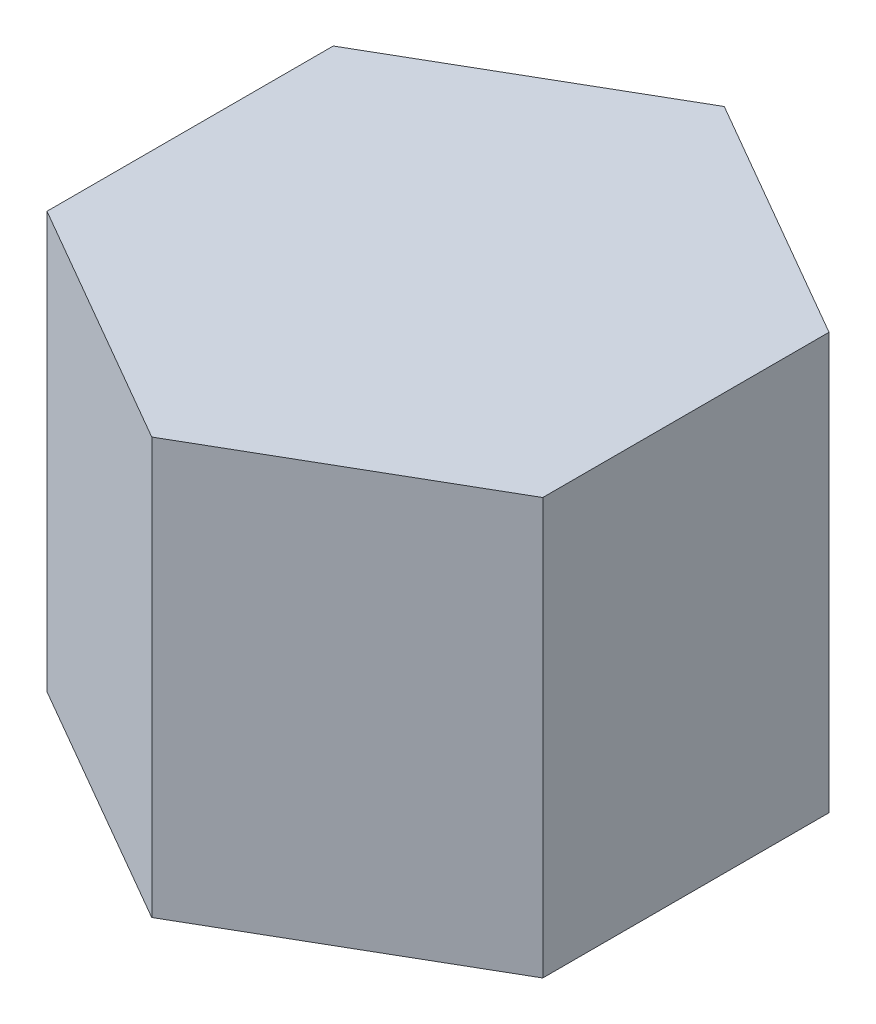
ISO-10303-21;
HEADER;
FILE_DESCRIPTION(('STEP AP214'),'2;1');
FILE_NAME('part.step','',(''),(''),'','','');
FILE_SCHEMA(('AUTOMOTIVE_DESIGN { 1 0 10303 214 1 1 1 1 }'));
ENDSEC;
DATA;
#1=APPLICATION_CONTEXT('core data for automotive mechanical design processes');
#2=APPLICATION_PROTOCOL_DEFINITION('international standard','automotive_design',2000,#1);
#3=PRODUCT_CONTEXT('',#1,'mechanical');
#4=PRODUCT('Part','Part','',(#3));
#5=PRODUCT_RELATED_PRODUCT_CATEGORY('part','',(#4));
#6=PRODUCT_DEFINITION_FORMATION('','',#4);
#7=PRODUCT_DEFINITION_CONTEXT('part definition',#1,'design');
#8=PRODUCT_DEFINITION('design','',#6,#7);
#9=PRODUCT_DEFINITION_SHAPE('','',#8);
#10=(LENGTH_UNIT() NAMED_UNIT(*) SI_UNIT(.MILLI.,.METRE.));
#11=(NAMED_UNIT(*) PLANE_ANGLE_UNIT() SI_UNIT($,.RADIAN.));
#12=(NAMED_UNIT(*) SI_UNIT($,.STERADIAN.) SOLID_ANGLE_UNIT());
#13=UNCERTAINTY_MEASURE_WITH_UNIT(LENGTH_MEASURE(1.E-05),#10,'distance_accuracy_value','');
#14=(GEOMETRIC_REPRESENTATION_CONTEXT(3) GLOBAL_UNCERTAINTY_ASSIGNED_CONTEXT((#13)) GLOBAL_UNIT_ASSIGNED_CONTEXT((#10,
#11,#12)) REPRESENTATION_CONTEXT('',''));
#15=CARTESIAN_POINT('',(0.,0.,0.));
#16=DIRECTION('',(0.,0.,1.));
#17=DIRECTION('',(1.,0.,0.));
#18=AXIS2_PLACEMENT_3D('',#15,#16,#17);
#19=CARTESIAN_POINT('',(205.839551417382,-147.556598747966,289.083895009141));
#20=DIRECTION('',(-0.499999999999943,0.,-0.866025403784471));
#21=DIRECTION('',(-0.866025403784471,0.,0.499999999999943));
#22=AXIS2_PLACEMENT_3D('',#19,#20,#21);
#23=PLANE('',#22);
#24=CARTESIAN_POINT('',(206.142660308706,-147.047793579175,288.908895009141));
#25=DIRECTION('',(-0.866025403784471,0.,0.499999999999943));
#26=VECTOR('',#25,1.);
#27=LINE('',#24,#26);
#28=CARTESIAN_POINT('',(206.142660308706,-147.047793579175,288.908895009141));
#29=VERTEX_POINT('',#28);
#30=CARTESIAN_POINT('',(205.839551417382,-147.047793579175,289.083895009141));
#31=VERTEX_POINT('',#30);
#32=EDGE_CURVE('E170',#29,#31,#27,.T.);
#33=ORIENTED_EDGE('',*,*,#32,.T.);
#34=CARTESIAN_POINT('',(205.839551417382,-147.556598747966,289.083895009141));
#35=DIRECTION('',(0.,1.,0.));
#36=VECTOR('',#35,1.);
#37=LINE('',#34,#36);
#38=CARTESIAN_POINT('',(205.839551417382,-147.556598747966,289.083895009141));
#39=VERTEX_POINT('',#38);
#40=EDGE_CURVE('E35',#39,#31,#37,.T.);
#41=ORIENTED_EDGE('',*,*,#40,.F.);
#42=CARTESIAN_POINT('',(206.142660308706,-147.556598747966,288.908895009141));
#43=DIRECTION('',(-0.866025403784471,0.,0.499999999999943));
#44=VECTOR('',#43,1.);
#45=LINE('',#42,#44);
#46=CARTESIAN_POINT('',(206.142660308706,-147.556598747966,288.908895009141));
#47=VERTEX_POINT('',#46);
#48=EDGE_CURVE('E159',#47,#39,#45,.T.);
#49=ORIENTED_EDGE('',*,*,#48,.F.);
#50=CARTESIAN_POINT('',(206.142660308706,-147.556598747966,288.908895009141));
#51=DIRECTION('',(0.,1.,0.));
#52=VECTOR('',#51,1.);
#53=LINE('',#50,#52);
#54=EDGE_CURVE('E10',#47,#29,#53,.T.);
#55=ORIENTED_EDGE('',*,*,#54,.T.);
#56=EDGE_LOOP('',(#33,#41,#49,#55));
#57=FACE_BOUND('',#56,.T.);
#58=ADVANCED_FACE('F16',(#57),#23,.F.);
#59=CARTESIAN_POINT('',(206.142660308706,-147.556598747966,291.594471220494));
#60=DIRECTION('',(-1.,0.,0.));
#61=DIRECTION('',(0.,-1.,0.));
#62=AXIS2_PLACEMENT_3D('',#59,#60,#61);
#63=PLANE('',#62);
#64=CARTESIAN_POINT('',(206.142660308706,-147.047793579175,288.558895009141));
#65=DIRECTION('',(0.,0.,1.));
#66=VECTOR('',#65,1.);
#67=LINE('',#64,#66);
#68=CARTESIAN_POINT('',(206.142660308706,-147.047793579175,288.558895009141));
#69=VERTEX_POINT('',#68);
#70=EDGE_CURVE('E167',#69,#29,#67,.T.);
#71=ORIENTED_EDGE('',*,*,#70,.T.);
#72=ORIENTED_EDGE('',*,*,#54,.F.);
#73=CARTESIAN_POINT('',(206.142660308706,-147.556598747966,288.558895009141));
#74=DIRECTION('',(0.,0.,1.));
#75=VECTOR('',#74,1.);
#76=LINE('',#73,#75);
#77=CARTESIAN_POINT('',(206.142660308706,-147.556598747966,288.558895009141));
#78=VERTEX_POINT('',#77);
#79=EDGE_CURVE('E156',#78,#47,#76,.T.);
#80=ORIENTED_EDGE('',*,*,#79,.F.);
#81=CARTESIAN_POINT('',(206.142660308706,-147.556598747966,288.558895009141));
#82=DIRECTION('',(0.,1.,0.));
#83=VECTOR('',#82,1.);
#84=LINE('',#81,#83);
#85=EDGE_CURVE('E27',#78,#69,#84,.T.);
#86=ORIENTED_EDGE('',*,*,#85,.T.);
#87=EDGE_LOOP('',(#71,#72,#80,#86));
#88=FACE_BOUND('',#87,.T.);
#89=ADVANCED_FACE('F189',(#88),#63,.F.);
#90=CARTESIAN_POINT('',(206.142660308706,-147.556598747966,288.558895009141));
#91=DIRECTION('',(-0.499999999999943,0.,0.866025403784471));
#92=DIRECTION('',(0.866025403784471,0.,0.499999999999943));
#93=AXIS2_PLACEMENT_3D('',#90,#91,#92);
#94=PLANE('',#93);
#95=CARTESIAN_POINT('',(205.839551417382,-147.047793579175,288.383895009141));
#96=DIRECTION('',(0.866025403784471,0.,0.499999999999943));
#97=VECTOR('',#96,1.);
#98=LINE('',#95,#97);
#99=CARTESIAN_POINT('',(205.839551417382,-147.047793579175,288.383895009141));
#100=VERTEX_POINT('',#99);
#101=EDGE_CURVE('E163',#100,#69,#98,.T.);
#102=ORIENTED_EDGE('',*,*,#101,.T.);
#103=ORIENTED_EDGE('',*,*,#85,.F.);
#104=CARTESIAN_POINT('',(205.839551417382,-147.556598747966,288.383895009141));
#105=DIRECTION('',(0.866025403784471,0.,0.499999999999943));
#106=VECTOR('',#105,1.);
#107=LINE('',#104,#106);
#108=CARTESIAN_POINT('',(205.839551417382,-147.556598747966,288.383895009141));
#109=VERTEX_POINT('',#108);
#110=EDGE_CURVE('E106',#109,#78,#107,.T.);
#111=ORIENTED_EDGE('',*,*,#110,.F.);
#112=CARTESIAN_POINT('',(205.839551417382,-147.556598747966,288.383895009141));
#113=DIRECTION('',(0.,1.,0.));
#114=VECTOR('',#113,1.);
#115=LINE('',#112,#114);
#116=EDGE_CURVE('E94',#109,#100,#115,.T.);
#117=ORIENTED_EDGE('',*,*,#116,.T.);
#118=EDGE_LOOP('',(#102,#103,#111,#117));
#119=FACE_BOUND('',#118,.T.);
#120=ADVANCED_FACE('F198',(#119),#94,.F.);
#121=CARTESIAN_POINT('',(205.839551417382,-147.556598747966,288.383895009141));
#122=DIRECTION('',(0.499999999999978,0.,0.866025403784452));
#123=DIRECTION('',(0.866025403784452,0.,-0.499999999999978));
#124=AXIS2_PLACEMENT_3D('',#121,#122,#123);
#125=PLANE('',#124);
#126=CARTESIAN_POINT('',(205.536442526057,-147.047793579175,288.558895009141));
#127=DIRECTION('',(0.866025403784452,0.,-0.499999999999978));
#128=VECTOR('',#127,1.);
#129=LINE('',#126,#128);
#130=CARTESIAN_POINT('',(205.536442526057,-147.047793579175,288.558895009141));
#131=VERTEX_POINT('',#130);
#132=EDGE_CURVE('E162',#131,#100,#129,.T.);
#133=ORIENTED_EDGE('',*,*,#132,.T.);
#134=ORIENTED_EDGE('',*,*,#116,.F.);
#135=CARTESIAN_POINT('',(205.536442526057,-147.556598747966,288.558895009141));
#136=DIRECTION('',(0.866025403784452,0.,-0.499999999999978));
#137=VECTOR('',#136,1.);
#138=LINE('',#135,#137);
#139=CARTESIAN_POINT('',(205.536442526057,-147.556598747966,288.558895009141));
#140=VERTEX_POINT('',#139);
#141=EDGE_CURVE('E98',#140,#109,#138,.T.);
#142=ORIENTED_EDGE('',*,*,#141,.F.);
#143=CARTESIAN_POINT('',(205.536442526057,-147.556598747966,288.558895009141));
#144=DIRECTION('',(0.,1.,0.));
#145=VECTOR('',#144,1.);
#146=LINE('',#143,#145);
#147=EDGE_CURVE('E79',#140,#131,#146,.T.);
#148=ORIENTED_EDGE('',*,*,#147,.T.);
#149=EDGE_LOOP('',(#133,#134,#142,#148));
#150=FACE_BOUND('',#149,.T.);
#151=ADVANCED_FACE('F100',(#150),#125,.F.);
#152=CARTESIAN_POINT('',(205.536442526057,-147.556598747966,291.594471220494));
#153=DIRECTION('',(1.,0.,0.));
#154=DIRECTION('',(0.,1.,0.));
#155=AXIS2_PLACEMENT_3D('',#152,#153,#154);
#156=PLANE('',#155);
#157=CARTESIAN_POINT('',(205.536442526057,-147.047793579175,288.908895009141));
#158=DIRECTION('',(0.,0.,-1.));
#159=VECTOR('',#158,1.);
#160=LINE('',#157,#159);
#161=CARTESIAN_POINT('',(205.536442526057,-147.047793579175,288.908895009141));
#162=VERTEX_POINT('',#161);
#163=EDGE_CURVE('E88',#162,#131,#160,.T.);
#164=ORIENTED_EDGE('',*,*,#163,.T.);
#165=ORIENTED_EDGE('',*,*,#147,.F.);
#166=CARTESIAN_POINT('',(205.536442526057,-147.556598747966,288.908895009141));
#167=DIRECTION('',(0.,0.,-1.));
#168=VECTOR('',#167,1.);
#169=LINE('',#166,#168);
#170=CARTESIAN_POINT('',(205.536442526057,-147.556598747966,288.908895009141));
#171=VERTEX_POINT('',#170);
#172=EDGE_CURVE('E84',#171,#140,#169,.T.);
#173=ORIENTED_EDGE('',*,*,#172,.F.);
#174=CARTESIAN_POINT('',(205.536442526057,-147.556598747966,288.908895009141));
#175=DIRECTION('',(0.,1.,0.));
#176=VECTOR('',#175,1.);
#177=LINE('',#174,#176);
#178=EDGE_CURVE('E58',#171,#162,#177,.T.);
#179=ORIENTED_EDGE('',*,*,#178,.T.);
#180=EDGE_LOOP('',(#164,#165,#173,#179));
#181=FACE_BOUND('',#180,.T.);
#182=ADVANCED_FACE('F82',(#181),#156,.F.);
#183=CARTESIAN_POINT('',(205.536442526057,-147.556598747966,288.908895009141));
#184=DIRECTION('',(0.499999999999943,0.,-0.866025403784471));
#185=DIRECTION('',(-0.866025403784471,0.,-0.499999999999943));
#186=AXIS2_PLACEMENT_3D('',#183,#184,#185);
#187=PLANE('',#186);
#188=CARTESIAN_POINT('',(205.839551417382,-147.047793579175,289.083895009141));
#189=DIRECTION('',(-0.866025403784471,0.,-0.499999999999943));
#190=VECTOR('',#189,1.);
#191=LINE('',#188,#190);
#192=EDGE_CURVE('E160',#31,#162,#191,.T.);
#193=ORIENTED_EDGE('',*,*,#192,.T.);
#194=ORIENTED_EDGE('',*,*,#178,.F.);
#195=CARTESIAN_POINT('',(205.839551417382,-147.556598747966,289.083895009141));
#196=DIRECTION('',(-0.866025403784471,0.,-0.499999999999943));
#197=VECTOR('',#196,1.);
#198=LINE('',#195,#197);
#199=EDGE_CURVE('E112',#39,#171,#198,.T.);
#200=ORIENTED_EDGE('',*,*,#199,.F.);
#201=ORIENTED_EDGE('',*,*,#40,.T.);
#202=EDGE_LOOP('',(#193,#194,#200,#201));
#203=FACE_BOUND('',#202,.T.);
#204=ADVANCED_FACE('F131',(#203),#187,.F.);
#205=CARTESIAN_POINT('',(206.491105863044,-147.556598747966,291.594471220494));
#206=DIRECTION('',(0.,1.,0.));
#207=DIRECTION('',(-1.,0.,0.));
#208=AXIS2_PLACEMENT_3D('',#205,#206,#207);
#209=PLANE('',#208);
#210=ORIENTED_EDGE('',*,*,#48,.T.);
#211=ORIENTED_EDGE('',*,*,#199,.T.);
#212=ORIENTED_EDGE('',*,*,#172,.T.);
#213=ORIENTED_EDGE('',*,*,#141,.T.);
#214=ORIENTED_EDGE('',*,*,#110,.T.);
#215=ORIENTED_EDGE('',*,*,#79,.T.);
#216=EDGE_LOOP('',(#210,#211,#212,#213,#214,#215));
#217=FACE_BOUND('',#216,.T.);
#218=ADVANCED_FACE('F111',(#217),#209,.F.);
#219=CARTESIAN_POINT('',(206.491105863044,-147.047793579175,291.594471220494));
#220=DIRECTION('',(0.,1.,0.));
#221=DIRECTION('',(-1.,0.,0.));
#222=AXIS2_PLACEMENT_3D('',#219,#220,#221);
#223=PLANE('',#222);
#224=ORIENTED_EDGE('',*,*,#32,.F.);
#225=ORIENTED_EDGE('',*,*,#70,.F.);
#226=ORIENTED_EDGE('',*,*,#101,.F.);
#227=ORIENTED_EDGE('',*,*,#132,.F.);
#228=ORIENTED_EDGE('',*,*,#163,.F.);
#229=ORIENTED_EDGE('',*,*,#192,.F.);
#230=EDGE_LOOP('',(#224,#225,#226,#227,#228,#229));
#231=FACE_BOUND('',#230,.T.);
#232=ADVANCED_FACE('F130',(#231),#223,.T.);
#233=CLOSED_SHELL('',(#58,#89,#120,#151,#182,#204,#218,#232));
#234=MANIFOLD_SOLID_BREP('B1',#233);
#235=ADVANCED_BREP_SHAPE_REPRESENTATION('',(#18,#234),#14);
#236=SHAPE_DEFINITION_REPRESENTATION(#9,#235);
ENDSEC;
END-ISO-10303-21;
